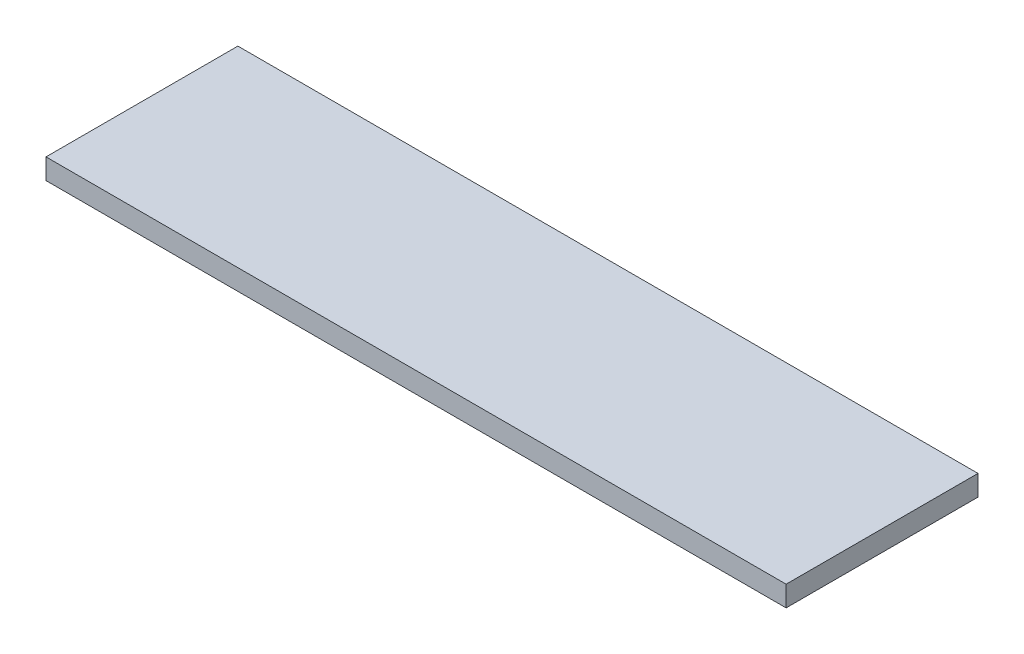
ISO-10303-21;
HEADER;
FILE_DESCRIPTION(('STEP AP214'),'2;1');
FILE_NAME('part.step','',(''),(''),'','','');
FILE_SCHEMA(('AUTOMOTIVE_DESIGN { 1 0 10303 214 1 1 1 1 }'));
ENDSEC;
DATA;
#1=APPLICATION_CONTEXT('core data for automotive mechanical design processes');
#2=APPLICATION_PROTOCOL_DEFINITION('international standard','automotive_design',2000,#1);
#3=PRODUCT_CONTEXT('',#1,'mechanical');
#4=PRODUCT('Part','Part','',(#3));
#5=PRODUCT_RELATED_PRODUCT_CATEGORY('part','',(#4));
#6=PRODUCT_DEFINITION_FORMATION('','',#4);
#7=PRODUCT_DEFINITION_CONTEXT('part definition',#1,'design');
#8=PRODUCT_DEFINITION('design','',#6,#7);
#9=PRODUCT_DEFINITION_SHAPE('','',#8);
#10=(LENGTH_UNIT() NAMED_UNIT(*) SI_UNIT(.MILLI.,.METRE.));
#11=(NAMED_UNIT(*) PLANE_ANGLE_UNIT() SI_UNIT($,.RADIAN.));
#12=(NAMED_UNIT(*) SI_UNIT($,.STERADIAN.) SOLID_ANGLE_UNIT());
#13=UNCERTAINTY_MEASURE_WITH_UNIT(LENGTH_MEASURE(1.E-05),#10,'distance_accuracy_value','');
#14=(GEOMETRIC_REPRESENTATION_CONTEXT(3) GLOBAL_UNCERTAINTY_ASSIGNED_CONTEXT((#13)) GLOBAL_UNIT_ASSIGNED_CONTEXT((#10,
#11,#12)) REPRESENTATION_CONTEXT('',''));
#15=CARTESIAN_POINT('',(0.,0.,0.));
#16=DIRECTION('',(0.,0.,1.));
#17=DIRECTION('',(1.,0.,0.));
#18=AXIS2_PLACEMENT_3D('',#15,#16,#17);
#19=CARTESIAN_POINT('',(342.9,9.525,-88.9));
#20=DIRECTION('',(-1.,0.,0.));
#21=DIRECTION('',(0.,0.,1.));
#22=AXIS2_PLACEMENT_3D('',#19,#20,#21);
#23=PLANE('',#22);
#24=DIRECTION('',(0.,0.,-1.));
#25=VECTOR('',#24,1.);
#26=CARTESIAN_POINT('',(342.9,-9.525,-88.9));
#27=LINE('',#26,#25);
#28=CARTESIAN_POINT('',(342.9,-9.525,88.9));
#29=VERTEX_POINT('',#28);
#30=CARTESIAN_POINT('',(342.9,-9.525,-88.9));
#31=VERTEX_POINT('',#30);
#32=EDGE_CURVE('E96',#29,#31,#27,.T.);
#33=ORIENTED_EDGE('',*,*,#32,.T.);
#34=DIRECTION('',(0.,-1.,0.));
#35=VECTOR('',#34,1.);
#36=CARTESIAN_POINT('',(342.9,9.525,-88.9));
#37=LINE('',#36,#35);
#38=CARTESIAN_POINT('',(342.9,9.525,-88.9));
#39=VERTEX_POINT('',#38);
#40=EDGE_CURVE('E11',#39,#31,#37,.T.);
#41=ORIENTED_EDGE('',*,*,#40,.F.);
#42=DIRECTION('',(0.,0.,-1.));
#43=VECTOR('',#42,1.);
#44=CARTESIAN_POINT('',(342.9,9.525,-88.9));
#45=LINE('',#44,#43);
#46=CARTESIAN_POINT('',(342.9,9.525,88.9));
#47=VERTEX_POINT('',#46);
#48=EDGE_CURVE('E84',#47,#39,#45,.T.);
#49=ORIENTED_EDGE('',*,*,#48,.F.);
#50=DIRECTION('',(0.,-1.,0.));
#51=VECTOR('',#50,1.);
#52=CARTESIAN_POINT('',(342.9,9.525,88.9));
#53=LINE('',#52,#51);
#54=EDGE_CURVE('E92',#47,#29,#53,.T.);
#55=ORIENTED_EDGE('',*,*,#54,.T.);
#56=EDGE_LOOP('',(#33,#41,#49,#55));
#57=FACE_BOUND('',#56,.T.);
#58=ADVANCED_FACE('F33',(#57),#23,.F.);
#59=CARTESIAN_POINT('',(-342.9,9.525,-88.9));
#60=DIRECTION('',(0.,0.,1.));
#61=DIRECTION('',(1.,0.,0.));
#62=AXIS2_PLACEMENT_3D('',#59,#60,#61);
#63=PLANE('',#62);
#64=DIRECTION('',(-1.,0.,0.));
#65=VECTOR('',#64,1.);
#66=CARTESIAN_POINT('',(-342.9,-9.525,-88.9));
#67=LINE('',#66,#65);
#68=CARTESIAN_POINT('',(-342.9,-9.525,-88.9));
#69=VERTEX_POINT('',#68);
#70=EDGE_CURVE('E88',#31,#69,#67,.T.);
#71=ORIENTED_EDGE('',*,*,#70,.T.);
#72=DIRECTION('',(0.,-1.,0.));
#73=VECTOR('',#72,1.);
#74=CARTESIAN_POINT('',(-342.9,9.525,-88.9));
#75=LINE('',#74,#73);
#76=CARTESIAN_POINT('',(-342.9,9.525,-88.9));
#77=VERTEX_POINT('',#76);
#78=EDGE_CURVE('E41',#77,#69,#75,.T.);
#79=ORIENTED_EDGE('',*,*,#78,.F.);
#80=DIRECTION('',(-1.,0.,0.));
#81=VECTOR('',#80,1.);
#82=CARTESIAN_POINT('',(-342.9,9.525,-88.9));
#83=LINE('',#82,#81);
#84=EDGE_CURVE('E79',#39,#77,#83,.T.);
#85=ORIENTED_EDGE('',*,*,#84,.F.);
#86=ORIENTED_EDGE('',*,*,#40,.T.);
#87=EDGE_LOOP('',(#71,#79,#85,#86));
#88=FACE_BOUND('',#87,.T.);
#89=ADVANCED_FACE('F87',(#88),#63,.F.);
#90=CARTESIAN_POINT('',(-342.9,9.525,-88.9));
#91=DIRECTION('',(1.,0.,0.));
#92=DIRECTION('',(0.,0.,-1.));
#93=AXIS2_PLACEMENT_3D('',#90,#91,#92);
#94=PLANE('',#93);
#95=DIRECTION('',(0.,0.,1.));
#96=VECTOR('',#95,1.);
#97=CARTESIAN_POINT('',(-342.9,-9.525,-88.9));
#98=LINE('',#97,#96);
#99=CARTESIAN_POINT('',(-342.9,-9.525,88.9));
#100=VERTEX_POINT('',#99);
#101=EDGE_CURVE('E66',#69,#100,#98,.T.);
#102=ORIENTED_EDGE('',*,*,#101,.T.);
#103=DIRECTION('',(0.,-1.,0.));
#104=VECTOR('',#103,1.);
#105=CARTESIAN_POINT('',(-342.9,9.525,88.9));
#106=LINE('',#105,#104);
#107=CARTESIAN_POINT('',(-342.9,9.525,88.9));
#108=VERTEX_POINT('',#107);
#109=EDGE_CURVE('E89',#108,#100,#106,.T.);
#110=ORIENTED_EDGE('',*,*,#109,.F.);
#111=DIRECTION('',(0.,0.,1.));
#112=VECTOR('',#111,1.);
#113=CARTESIAN_POINT('',(-342.9,9.525,-88.9));
#114=LINE('',#113,#112);
#115=EDGE_CURVE('E82',#77,#108,#114,.T.);
#116=ORIENTED_EDGE('',*,*,#115,.F.);
#117=ORIENTED_EDGE('',*,*,#78,.T.);
#118=EDGE_LOOP('',(#102,#110,#116,#117));
#119=FACE_BOUND('',#118,.T.);
#120=ADVANCED_FACE('F90',(#119),#94,.F.);
#121=CARTESIAN_POINT('',(-342.9,9.525,88.9));
#122=DIRECTION('',(0.,0.,-1.));
#123=DIRECTION('',(-1.,0.,0.));
#124=AXIS2_PLACEMENT_3D('',#121,#122,#123);
#125=PLANE('',#124);
#126=DIRECTION('',(1.,0.,0.));
#127=VECTOR('',#126,1.);
#128=CARTESIAN_POINT('',(-342.9,-9.525,88.9));
#129=LINE('',#128,#127);
#130=EDGE_CURVE('E72',#100,#29,#129,.T.);
#131=ORIENTED_EDGE('',*,*,#130,.T.);
#132=ORIENTED_EDGE('',*,*,#54,.F.);
#133=DIRECTION('',(1.,0.,0.));
#134=VECTOR('',#133,1.);
#135=CARTESIAN_POINT('',(-342.9,9.525,88.9));
#136=LINE('',#135,#134);
#137=EDGE_CURVE('E49',#108,#47,#136,.T.);
#138=ORIENTED_EDGE('',*,*,#137,.F.);
#139=ORIENTED_EDGE('',*,*,#109,.T.);
#140=EDGE_LOOP('',(#131,#132,#138,#139));
#141=FACE_BOUND('',#140,.T.);
#142=ADVANCED_FACE('F103',(#141),#125,.F.);
#143=CARTESIAN_POINT('',(0.,9.525,0.));
#144=DIRECTION('',(0.,1.,0.));
#145=DIRECTION('',(0.,0.,1.));
#146=AXIS2_PLACEMENT_3D('',#143,#144,#145);
#147=PLANE('',#146);
#148=ORIENTED_EDGE('',*,*,#48,.T.);
#149=ORIENTED_EDGE('',*,*,#84,.T.);
#150=ORIENTED_EDGE('',*,*,#115,.T.);
#151=ORIENTED_EDGE('',*,*,#137,.T.);
#152=EDGE_LOOP('',(#148,#149,#150,#151));
#153=FACE_BOUND('',#152,.T.);
#154=ADVANCED_FACE('F80',(#153),#147,.T.);
#155=CARTESIAN_POINT('',(0.,-9.525,0.));
#156=DIRECTION('',(0.,1.,0.));
#157=DIRECTION('',(0.,0.,1.));
#158=AXIS2_PLACEMENT_3D('',#155,#156,#157);
#159=PLANE('',#158);
#160=ORIENTED_EDGE('',*,*,#32,.F.);
#161=ORIENTED_EDGE('',*,*,#130,.F.);
#162=ORIENTED_EDGE('',*,*,#101,.F.);
#163=ORIENTED_EDGE('',*,*,#70,.F.);
#164=EDGE_LOOP('',(#160,#161,#162,#163));
#165=FACE_BOUND('',#164,.T.);
#166=ADVANCED_FACE('F106',(#165),#159,.F.);
#167=CLOSED_SHELL('',(#58,#89,#120,#142,#154,#166));
#168=MANIFOLD_SOLID_BREP('B2',#167);
#169=ADVANCED_BREP_SHAPE_REPRESENTATION('',(#18,#168),#14);
#170=SHAPE_DEFINITION_REPRESENTATION(#9,#169);
ENDSEC;
END-ISO-10303-21;
